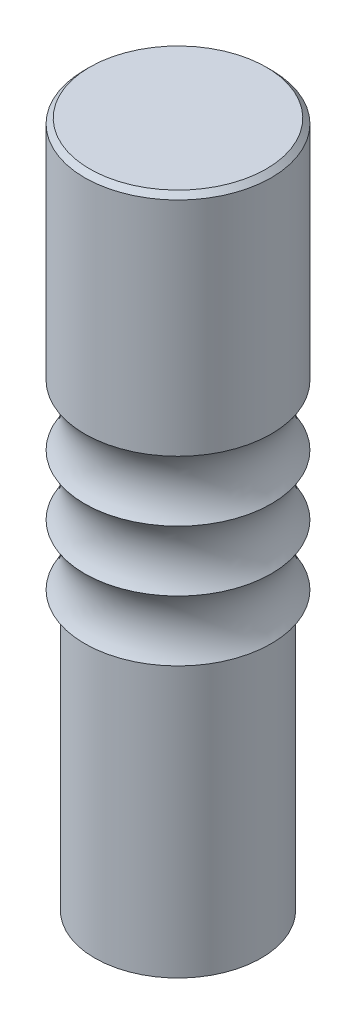
ISO-10303-21;
HEADER;
FILE_DESCRIPTION(('STEP AP214'),'2;1');
FILE_NAME('part.step','',(''),(''),'','','');
FILE_SCHEMA(('AUTOMOTIVE_DESIGN { 1 0 10303 214 1 1 1 1 }'));
ENDSEC;
DATA;
#1=APPLICATION_CONTEXT('core data for automotive mechanical design processes');
#2=APPLICATION_PROTOCOL_DEFINITION('international standard','automotive_design',2000,#1);
#3=PRODUCT_CONTEXT('',#1,'mechanical');
#4=PRODUCT('Part','Part','',(#3));
#5=PRODUCT_RELATED_PRODUCT_CATEGORY('part','',(#4));
#6=PRODUCT_DEFINITION_FORMATION('','',#4);
#7=PRODUCT_DEFINITION_CONTEXT('part definition',#1,'design');
#8=PRODUCT_DEFINITION('design','',#6,#7);
#9=PRODUCT_DEFINITION_SHAPE('','',#8);
#10=(LENGTH_UNIT() NAMED_UNIT(*) SI_UNIT(.MILLI.,.METRE.));
#11=(NAMED_UNIT(*) PLANE_ANGLE_UNIT() SI_UNIT($,.RADIAN.));
#12=(NAMED_UNIT(*) SI_UNIT($,.STERADIAN.) SOLID_ANGLE_UNIT());
#13=UNCERTAINTY_MEASURE_WITH_UNIT(LENGTH_MEASURE(1.E-05),#10,'distance_accuracy_value','');
#14=(GEOMETRIC_REPRESENTATION_CONTEXT(3) GLOBAL_UNCERTAINTY_ASSIGNED_CONTEXT((#13)) GLOBAL_UNIT_ASSIGNED_CONTEXT((#10,
#11,#12)) REPRESENTATION_CONTEXT('',''));
#15=CARTESIAN_POINT('',(0.,0.,0.));
#16=DIRECTION('',(0.,0.,1.));
#17=DIRECTION('',(1.,0.,0.));
#18=AXIS2_PLACEMENT_3D('',#15,#16,#17);
#19=CARTESIAN_POINT('',(0.,55.,0.));
#20=DIRECTION('',(0.,-1.,0.));
#21=DIRECTION('',(0.,0.,-1.));
#22=AXIS2_PLACEMENT_3D('',#19,#20,#21);
#23=CYLINDRICAL_SURFACE('',#22,16.5);
#24=CARTESIAN_POINT('',(0.,55.,0.));
#25=DIRECTION('',(0.,1.,0.));
#26=DIRECTION('',(0.,0.,1.));
#27=AXIS2_PLACEMENT_3D('',#24,#25,#26);
#28=CIRCLE('',#27,16.5);
#29=CARTESIAN_POINT('',(0.,55.,16.5));
#30=VERTEX_POINT('',#29);
#31=EDGE_CURVE('E42',#30,#30,#28,.T.);
#32=ORIENTED_EDGE('',*,*,#31,.F.);
#33=EDGE_LOOP('',(#32));
#34=FACE_BOUND('',#33,.T.);
#35=CARTESIAN_POINT('',(0.,0.,0.));
#36=DIRECTION('',(0.,1.,0.));
#37=DIRECTION('',(0.,0.,1.));
#38=AXIS2_PLACEMENT_3D('',#35,#36,#37);
#39=CIRCLE('',#38,16.5);
#40=CARTESIAN_POINT('',(0.,0.,16.5));
#41=VERTEX_POINT('',#40);
#42=EDGE_CURVE('E46',#41,#41,#39,.T.);
#43=ORIENTED_EDGE('',*,*,#42,.T.);
#44=EDGE_LOOP('',(#43));
#45=FACE_BOUND('',#44,.T.);
#46=ADVANCED_FACE('F31',(#34,#45),#23,.T.);
#47=CARTESIAN_POINT('',(0.,0.,0.));
#48=DIRECTION('',(0.,1.,0.));
#49=DIRECTION('',(0.,0.,1.));
#50=AXIS2_PLACEMENT_3D('',#47,#48,#49);
#51=PLANE('',#50);
#52=ORIENTED_EDGE('',*,*,#42,.F.);
#53=EDGE_LOOP('',(#52));
#54=FACE_BOUND('',#53,.T.);
#55=ADVANCED_FACE('F79',(#54),#51,.F.);
#56=CARTESIAN_POINT('',(18.5,136.,0.));
#57=DIRECTION('',(0.,-1.,0.));
#58=DIRECTION('',(1.,0.,0.));
#59=AXIS2_PLACEMENT_3D('',#56,#57,#58);
#60=PLANE('',#59);
#61=CARTESIAN_POINT('',(0.,136.,0.));
#62=DIRECTION('',(0.,-1.,0.));
#63=DIRECTION('',(1.,0.,0.));
#64=AXIS2_PLACEMENT_3D('',#61,#62,#63);
#65=CIRCLE('',#64,17.5);
#66=CARTESIAN_POINT('',(17.5,136.,0.));
#67=VERTEX_POINT('',#66);
#68=EDGE_CURVE('E38',#67,#67,#65,.F.);
#69=ORIENTED_EDGE('',*,*,#68,.T.);
#70=EDGE_LOOP('',(#69));
#71=FACE_BOUND('',#70,.T.);
#72=ADVANCED_FACE('F84',(#71),#60,.F.);
#73=CARTESIAN_POINT('',(0.,136.,0.));
#74=DIRECTION('',(0.,1.,0.));
#75=DIRECTION('',(-1.,0.,0.));
#76=AXIS2_PLACEMENT_3D('',#73,#74,#75);
#77=CYLINDRICAL_SURFACE('',#76,18.5);
#78=CARTESIAN_POINT('',(0.,135.,0.));
#79=DIRECTION('',(0.,-1.,0.));
#80=DIRECTION('',(1.,0.,0.));
#81=AXIS2_PLACEMENT_3D('',#78,#79,#80);
#82=CIRCLE('',#81,18.5);
#83=CARTESIAN_POINT('',(18.5,135.,0.));
#84=VERTEX_POINT('',#83);
#85=EDGE_CURVE('E10',#84,#84,#82,.T.);
#86=ORIENTED_EDGE('',*,*,#85,.T.);
#87=EDGE_LOOP('',(#86));
#88=FACE_BOUND('',#87,.T.);
#89=CARTESIAN_POINT('',(0.,91.,0.));
#90=DIRECTION('',(0.,1.,0.));
#91=DIRECTION('',(-1.,0.,0.));
#92=AXIS2_PLACEMENT_3D('',#89,#90,#91);
#93=CIRCLE('',#92,18.5);
#94=CARTESIAN_POINT('',(-18.5,91.,0.));
#95=VERTEX_POINT('',#94);
#96=EDGE_CURVE('E50',#95,#95,#93,.T.);
#97=ORIENTED_EDGE('',*,*,#96,.T.);
#98=EDGE_LOOP('',(#97));
#99=FACE_BOUND('',#98,.T.);
#100=ADVANCED_FACE('F92',(#88,#99),#77,.T.);
#101=CARTESIAN_POINT('',(0.,85.,0.));
#102=DIRECTION('',(0.,1.,0.));
#103=DIRECTION('',(-1.,0.,0.));
#104=AXIS2_PLACEMENT_3D('',#101,#102,#103);
#105=TOROIDAL_SURFACE('',#104,26.5,10.);
#106=ORIENTED_EDGE('',*,*,#96,.F.);
#107=EDGE_LOOP('',(#106));
#108=FACE_BOUND('',#107,.T.);
#109=CARTESIAN_POINT('',(0.,79.,0.));
#110=DIRECTION('',(0.,1.,0.));
#111=DIRECTION('',(-1.,0.,0.));
#112=AXIS2_PLACEMENT_3D('',#109,#110,#111);
#113=CIRCLE('',#112,18.5);
#114=CARTESIAN_POINT('',(-18.5,79.,0.));
#115=VERTEX_POINT('',#114);
#116=EDGE_CURVE('E54',#115,#115,#113,.T.);
#117=ORIENTED_EDGE('',*,*,#116,.T.);
#118=EDGE_LOOP('',(#117));
#119=FACE_BOUND('',#118,.T.);
#120=ADVANCED_FACE('F95',(#108,#119),#105,.F.);
#121=CARTESIAN_POINT('',(0.,73.,0.));
#122=DIRECTION('',(0.,1.,0.));
#123=DIRECTION('',(-1.,0.,0.));
#124=AXIS2_PLACEMENT_3D('',#121,#122,#123);
#125=TOROIDAL_SURFACE('',#124,26.5,10.);
#126=ORIENTED_EDGE('',*,*,#116,.F.);
#127=EDGE_LOOP('',(#126));
#128=FACE_BOUND('',#127,.T.);
#129=CARTESIAN_POINT('',(0.,67.,0.));
#130=DIRECTION('',(0.,1.,0.));
#131=DIRECTION('',(-1.,0.,0.));
#132=AXIS2_PLACEMENT_3D('',#129,#130,#131);
#133=CIRCLE('',#132,18.5);
#134=CARTESIAN_POINT('',(-18.5,67.,0.));
#135=VERTEX_POINT('',#134);
#136=EDGE_CURVE('E57',#135,#135,#133,.T.);
#137=ORIENTED_EDGE('',*,*,#136,.T.);
#138=EDGE_LOOP('',(#137));
#139=FACE_BOUND('',#138,.T.);
#140=ADVANCED_FACE('F75',(#128,#139),#125,.F.);
#141=CARTESIAN_POINT('',(0.,61.,0.));
#142=DIRECTION('',(0.,1.,0.));
#143=DIRECTION('',(-1.,0.,0.));
#144=AXIS2_PLACEMENT_3D('',#141,#142,#143);
#145=TOROIDAL_SURFACE('',#144,26.5,10.);
#146=ORIENTED_EDGE('',*,*,#136,.F.);
#147=EDGE_LOOP('',(#146));
#148=FACE_BOUND('',#147,.T.);
#149=CARTESIAN_POINT('',(0.,55.,0.));
#150=DIRECTION('',(0.,1.,0.));
#151=DIRECTION('',(-1.,0.,0.));
#152=AXIS2_PLACEMENT_3D('',#149,#150,#151);
#153=CIRCLE('',#152,18.5);
#154=CARTESIAN_POINT('',(-18.5,55.,0.));
#155=VERTEX_POINT('',#154);
#156=EDGE_CURVE('E60',#155,#155,#153,.T.);
#157=ORIENTED_EDGE('',*,*,#156,.T.);
#158=EDGE_LOOP('',(#157));
#159=FACE_BOUND('',#158,.T.);
#160=ADVANCED_FACE('F64',(#148,#159),#145,.F.);
#161=CARTESIAN_POINT('',(0.,55.,0.));
#162=DIRECTION('',(0.,1.,0.));
#163=DIRECTION('',(-1.,0.,0.));
#164=AXIS2_PLACEMENT_3D('',#161,#162,#163);
#165=PLANE('',#164);
#166=ORIENTED_EDGE('',*,*,#31,.T.);
#167=EDGE_LOOP('',(#166));
#168=FACE_BOUND('',#167,.T.);
#169=ORIENTED_EDGE('',*,*,#156,.F.);
#170=EDGE_LOOP('',(#169));
#171=FACE_BOUND('',#170,.T.);
#172=ADVANCED_FACE('F66',(#168,#171),#165,.F.);
#173=CARTESIAN_POINT('',(0.,136.,0.));
#174=DIRECTION('',(0.,-1.,0.));
#175=DIRECTION('',(1.,0.,0.));
#176=AXIS2_PLACEMENT_3D('',#173,#174,#175);
#177=CONICAL_SURFACE('',#176,17.5,0.785398163397448);
#178=ORIENTED_EDGE('',*,*,#85,.F.);
#179=EDGE_LOOP('',(#178));
#180=FACE_BOUND('',#179,.T.);
#181=ORIENTED_EDGE('',*,*,#68,.F.);
#182=EDGE_LOOP('',(#181));
#183=FACE_BOUND('',#182,.T.);
#184=ADVANCED_FACE('F33',(#180,#183),#177,.T.);
#185=CLOSED_SHELL('',(#46,#55,#72,#100,#120,#140,#160,#172,#184));
#186=MANIFOLD_SOLID_BREP('B2',#185);
#187=ADVANCED_BREP_SHAPE_REPRESENTATION('',(#18,#186),#14);
#188=SHAPE_DEFINITION_REPRESENTATION(#9,#187);
ENDSEC;
END-ISO-10303-21;
